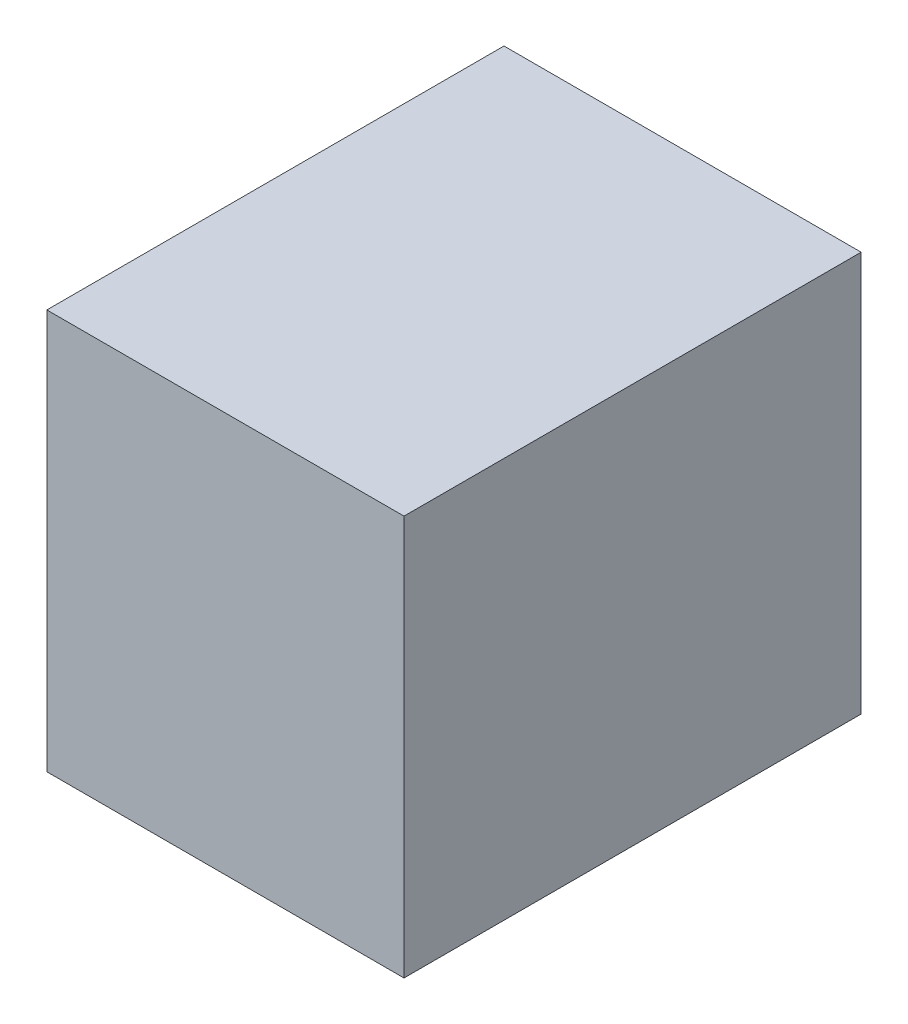
ISO-10303-21;
HEADER;
FILE_DESCRIPTION(('STEP AP214'),'2;1');
FILE_NAME('part.step','',(''),(''),'','','');
FILE_SCHEMA(('AUTOMOTIVE_DESIGN { 1 0 10303 214 1 1 1 1 }'));
ENDSEC;
DATA;
#1=APPLICATION_CONTEXT('core data for automotive mechanical design processes');
#2=APPLICATION_PROTOCOL_DEFINITION('international standard','automotive_design',2000,#1);
#3=PRODUCT_CONTEXT('',#1,'mechanical');
#4=PRODUCT('Part','Part','',(#3));
#5=PRODUCT_RELATED_PRODUCT_CATEGORY('part','',(#4));
#6=PRODUCT_DEFINITION_FORMATION('','',#4);
#7=PRODUCT_DEFINITION_CONTEXT('part definition',#1,'design');
#8=PRODUCT_DEFINITION('design','',#6,#7);
#9=PRODUCT_DEFINITION_SHAPE('','',#8);
#10=(LENGTH_UNIT() NAMED_UNIT(*) SI_UNIT(.MILLI.,.METRE.));
#11=(NAMED_UNIT(*) PLANE_ANGLE_UNIT() SI_UNIT($,.RADIAN.));
#12=(NAMED_UNIT(*) SI_UNIT($,.STERADIAN.) SOLID_ANGLE_UNIT());
#13=UNCERTAINTY_MEASURE_WITH_UNIT(LENGTH_MEASURE(1.E-05),#10,'distance_accuracy_value','');
#14=(GEOMETRIC_REPRESENTATION_CONTEXT(3) GLOBAL_UNCERTAINTY_ASSIGNED_CONTEXT((#13)) GLOBAL_UNIT_ASSIGNED_CONTEXT((#10,
#11,#12)) REPRESENTATION_CONTEXT('',''));
#15=CARTESIAN_POINT('',(0.,0.,0.));
#16=DIRECTION('',(0.,0.,1.));
#17=DIRECTION('',(1.,0.,0.));
#18=AXIS2_PLACEMENT_3D('',#15,#16,#17);
#19=CARTESIAN_POINT('',(250.,140.,-160.));
#20=DIRECTION('',(0.,0.,1.));
#21=DIRECTION('',(0.,-1.,0.));
#22=AXIS2_PLACEMENT_3D('',#19,#20,#21);
#23=PLANE('',#22);
#24=DIRECTION('',(0.,1.,0.));
#25=VECTOR('',#24,1.);
#26=CARTESIAN_POINT('',(0.,140.,-160.));
#27=LINE('',#26,#25);
#28=CARTESIAN_POINT('',(0.,-140.,-160.));
#29=VERTEX_POINT('',#28);
#30=CARTESIAN_POINT('',(0.,140.,-160.));
#31=VERTEX_POINT('',#30);
#32=EDGE_CURVE('E97',#29,#31,#27,.T.);
#33=ORIENTED_EDGE('',*,*,#32,.T.);
#34=DIRECTION('',(-1.,0.,0.));
#35=VECTOR('',#34,1.);
#36=CARTESIAN_POINT('',(250.,140.,-160.));
#37=LINE('',#36,#35);
#38=CARTESIAN_POINT('',(250.,140.,-160.));
#39=VERTEX_POINT('',#38);
#40=EDGE_CURVE('E11',#39,#31,#37,.T.);
#41=ORIENTED_EDGE('',*,*,#40,.F.);
#42=DIRECTION('',(0.,1.,0.));
#43=VECTOR('',#42,1.);
#44=CARTESIAN_POINT('',(250.,140.,-160.));
#45=LINE('',#44,#43);
#46=CARTESIAN_POINT('',(250.,-140.,-160.));
#47=VERTEX_POINT('',#46);
#48=EDGE_CURVE('E85',#47,#39,#45,.T.);
#49=ORIENTED_EDGE('',*,*,#48,.F.);
#50=DIRECTION('',(-1.,0.,0.));
#51=VECTOR('',#50,1.);
#52=CARTESIAN_POINT('',(250.,-140.,-160.));
#53=LINE('',#52,#51);
#54=EDGE_CURVE('E93',#47,#29,#53,.T.);
#55=ORIENTED_EDGE('',*,*,#54,.T.);
#56=EDGE_LOOP('',(#33,#41,#49,#55));
#57=FACE_BOUND('',#56,.T.);
#58=ADVANCED_FACE('F34',(#57),#23,.F.);
#59=CARTESIAN_POINT('',(250.,140.,160.));
#60=DIRECTION('',(0.,-1.,0.));
#61=DIRECTION('',(0.,0.,-1.));
#62=AXIS2_PLACEMENT_3D('',#59,#60,#61);
#63=PLANE('',#62);
#64=DIRECTION('',(0.,0.,1.));
#65=VECTOR('',#64,1.);
#66=CARTESIAN_POINT('',(0.,140.,160.));
#67=LINE('',#66,#65);
#68=CARTESIAN_POINT('',(0.,140.,160.));
#69=VERTEX_POINT('',#68);
#70=EDGE_CURVE('E89',#31,#69,#67,.T.);
#71=ORIENTED_EDGE('',*,*,#70,.T.);
#72=DIRECTION('',(-1.,0.,0.));
#73=VECTOR('',#72,1.);
#74=CARTESIAN_POINT('',(250.,140.,160.));
#75=LINE('',#74,#73);
#76=CARTESIAN_POINT('',(250.,140.,160.));
#77=VERTEX_POINT('',#76);
#78=EDGE_CURVE('E42',#77,#69,#75,.T.);
#79=ORIENTED_EDGE('',*,*,#78,.F.);
#80=DIRECTION('',(0.,0.,1.));
#81=VECTOR('',#80,1.);
#82=CARTESIAN_POINT('',(250.,140.,160.));
#83=LINE('',#82,#81);
#84=EDGE_CURVE('E80',#39,#77,#83,.T.);
#85=ORIENTED_EDGE('',*,*,#84,.F.);
#86=ORIENTED_EDGE('',*,*,#40,.T.);
#87=EDGE_LOOP('',(#71,#79,#85,#86));
#88=FACE_BOUND('',#87,.T.);
#89=ADVANCED_FACE('F88',(#88),#63,.F.);
#90=CARTESIAN_POINT('',(250.,140.,160.));
#91=DIRECTION('',(0.,0.,-1.));
#92=DIRECTION('',(0.,1.,0.));
#93=AXIS2_PLACEMENT_3D('',#90,#91,#92);
#94=PLANE('',#93);
#95=DIRECTION('',(0.,-1.,0.));
#96=VECTOR('',#95,1.);
#97=CARTESIAN_POINT('',(0.,140.,160.));
#98=LINE('',#97,#96);
#99=CARTESIAN_POINT('',(0.,-140.,160.));
#100=VERTEX_POINT('',#99);
#101=EDGE_CURVE('E67',#69,#100,#98,.T.);
#102=ORIENTED_EDGE('',*,*,#101,.T.);
#103=DIRECTION('',(-1.,0.,0.));
#104=VECTOR('',#103,1.);
#105=CARTESIAN_POINT('',(250.,-140.,160.));
#106=LINE('',#105,#104);
#107=CARTESIAN_POINT('',(250.,-140.,160.));
#108=VERTEX_POINT('',#107);
#109=EDGE_CURVE('E90',#108,#100,#106,.T.);
#110=ORIENTED_EDGE('',*,*,#109,.F.);
#111=DIRECTION('',(0.,-1.,0.));
#112=VECTOR('',#111,1.);
#113=CARTESIAN_POINT('',(250.,140.,160.));
#114=LINE('',#113,#112);
#115=EDGE_CURVE('E83',#77,#108,#114,.T.);
#116=ORIENTED_EDGE('',*,*,#115,.F.);
#117=ORIENTED_EDGE('',*,*,#78,.T.);
#118=EDGE_LOOP('',(#102,#110,#116,#117));
#119=FACE_BOUND('',#118,.T.);
#120=ADVANCED_FACE('F91',(#119),#94,.F.);
#121=CARTESIAN_POINT('',(250.,-140.,160.));
#122=DIRECTION('',(0.,1.,0.));
#123=DIRECTION('',(0.,0.,1.));
#124=AXIS2_PLACEMENT_3D('',#121,#122,#123);
#125=PLANE('',#124);
#126=DIRECTION('',(0.,0.,-1.));
#127=VECTOR('',#126,1.);
#128=CARTESIAN_POINT('',(0.,-140.,160.));
#129=LINE('',#128,#127);
#130=EDGE_CURVE('E73',#100,#29,#129,.T.);
#131=ORIENTED_EDGE('',*,*,#130,.T.);
#132=ORIENTED_EDGE('',*,*,#54,.F.);
#133=DIRECTION('',(0.,0.,-1.));
#134=VECTOR('',#133,1.);
#135=CARTESIAN_POINT('',(250.,-140.,160.));
#136=LINE('',#135,#134);
#137=EDGE_CURVE('E50',#108,#47,#136,.T.);
#138=ORIENTED_EDGE('',*,*,#137,.F.);
#139=ORIENTED_EDGE('',*,*,#109,.T.);
#140=EDGE_LOOP('',(#131,#132,#138,#139));
#141=FACE_BOUND('',#140,.T.);
#142=ADVANCED_FACE('F104',(#141),#125,.F.);
#143=CARTESIAN_POINT('',(250.,0.,0.));
#144=DIRECTION('',(1.,0.,0.));
#145=DIRECTION('',(0.,0.,-1.));
#146=AXIS2_PLACEMENT_3D('',#143,#144,#145);
#147=PLANE('',#146);
#148=ORIENTED_EDGE('',*,*,#48,.T.);
#149=ORIENTED_EDGE('',*,*,#84,.T.);
#150=ORIENTED_EDGE('',*,*,#115,.T.);
#151=ORIENTED_EDGE('',*,*,#137,.T.);
#152=EDGE_LOOP('',(#148,#149,#150,#151));
#153=FACE_BOUND('',#152,.T.);
#154=ADVANCED_FACE('F81',(#153),#147,.T.);
#155=CARTESIAN_POINT('',(0.,0.,0.));
#156=DIRECTION('',(1.,0.,0.));
#157=DIRECTION('',(0.,0.,-1.));
#158=AXIS2_PLACEMENT_3D('',#155,#156,#157);
#159=PLANE('',#158);
#160=ORIENTED_EDGE('',*,*,#32,.F.);
#161=ORIENTED_EDGE('',*,*,#130,.F.);
#162=ORIENTED_EDGE('',*,*,#101,.F.);
#163=ORIENTED_EDGE('',*,*,#70,.F.);
#164=EDGE_LOOP('',(#160,#161,#162,#163));
#165=FACE_BOUND('',#164,.T.);
#166=ADVANCED_FACE('F107',(#165),#159,.F.);
#167=CLOSED_SHELL('',(#58,#89,#120,#142,#154,#166));
#168=MANIFOLD_SOLID_BREP('B2',#167);
#169=ADVANCED_BREP_SHAPE_REPRESENTATION('',(#18,#168),#14);
#170=SHAPE_DEFINITION_REPRESENTATION(#9,#169);
ENDSEC;
END-ISO-10303-21;
